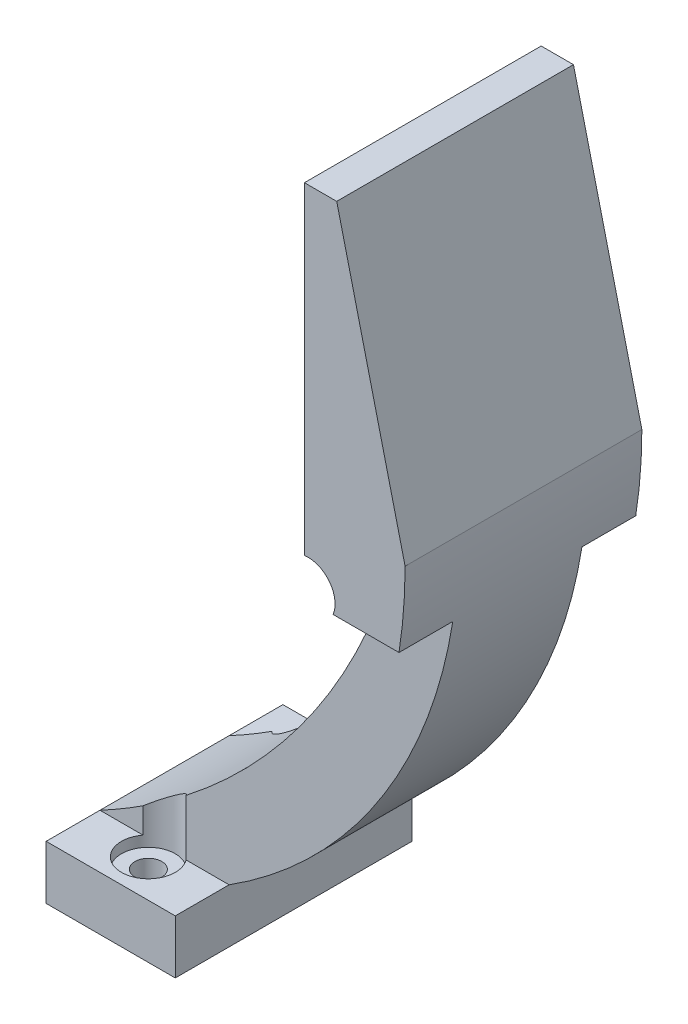
ISO-10303-21;
HEADER;
FILE_DESCRIPTION(('STEP AP214'),'2;1');
FILE_NAME('part.step','',(''),(''),'','','');
FILE_SCHEMA(('AUTOMOTIVE_DESIGN { 1 0 10303 214 1 1 1 1 }'));
ENDSEC;
DATA;
#1=APPLICATION_CONTEXT('core data for automotive mechanical design processes');
#2=APPLICATION_PROTOCOL_DEFINITION('international standard','automotive_design',2000,#1);
#3=PRODUCT_CONTEXT('',#1,'mechanical');
#4=PRODUCT('Part','Part','',(#3));
#5=PRODUCT_RELATED_PRODUCT_CATEGORY('part','',(#4));
#6=PRODUCT_DEFINITION_FORMATION('','',#4);
#7=PRODUCT_DEFINITION_CONTEXT('part definition',#1,'design');
#8=PRODUCT_DEFINITION('design','',#6,#7);
#9=PRODUCT_DEFINITION_SHAPE('','',#8);
#10=(LENGTH_UNIT() NAMED_UNIT(*) SI_UNIT(.MILLI.,.METRE.));
#11=(NAMED_UNIT(*) PLANE_ANGLE_UNIT() SI_UNIT($,.RADIAN.));
#12=(NAMED_UNIT(*) SI_UNIT($,.STERADIAN.) SOLID_ANGLE_UNIT());
#13=UNCERTAINTY_MEASURE_WITH_UNIT(LENGTH_MEASURE(1.E-05),#10,'distance_accuracy_value','');
#14=(GEOMETRIC_REPRESENTATION_CONTEXT(3) GLOBAL_UNCERTAINTY_ASSIGNED_CONTEXT((#13)) GLOBAL_UNIT_ASSIGNED_CONTEXT((#10,
#11,#12)) REPRESENTATION_CONTEXT('',''));
#15=CARTESIAN_POINT('',(0.,0.,0.));
#16=DIRECTION('',(0.,0.,1.));
#17=DIRECTION('',(1.,0.,0.));
#18=AXIS2_PLACEMENT_3D('',#15,#16,#17);
#19=CARTESIAN_POINT('',(33.356201637698,5.,5.));
#20=DIRECTION('',(0.,0.,1.));
#21=DIRECTION('',(1.,0.,0.));
#22=AXIS2_PLACEMENT_3D('',#19,#20,#21);
#23=PLANE('',#22);
#24=CARTESIAN_POINT('',(-26.3061199309047,54.2562220083352,5.));
#25=DIRECTION('',(0.,0.,1.));
#26=DIRECTION('',(1.,0.,0.));
#27=AXIS2_PLACEMENT_3D('',#24,#25,#26);
#28=CIRCLE('',#27,55.840732018425);
#29=CARTESIAN_POINT('',(0.,5.,5.));
#30=VERTEX_POINT('',#29);
#31=CARTESIAN_POINT('',(4.,7.35498058460349,5.));
#32=VERTEX_POINT('',#31);
#33=EDGE_CURVE('E291',#30,#32,#28,.T.);
#34=ORIENTED_EDGE('',*,*,#33,.T.);
#35=DIRECTION('',(0.,-1.,0.));
#36=VECTOR('',#35,1.);
#37=CARTESIAN_POINT('',(4.00000000000001,70.001,5.));
#38=LINE('',#37,#36);
#39=CARTESIAN_POINT('',(4.,5.00000000000001,5.));
#40=VERTEX_POINT('',#39);
#41=EDGE_CURVE('E398',#40,#32,#38,.F.);
#42=ORIENTED_EDGE('',*,*,#41,.F.);
#43=DIRECTION('',(-1.,0.,0.));
#44=VECTOR('',#43,1.);
#45=CARTESIAN_POINT('',(33.356201637698,5.,5.));
#46=LINE('',#45,#44);
#47=EDGE_CURVE('E171',#40,#30,#46,.T.);
#48=ORIENTED_EDGE('',*,*,#47,.T.);
#49=EDGE_LOOP('',(#34,#42,#48));
#50=FACE_BOUND('',#49,.T.);
#51=ADVANCED_FACE('F33',(#50),#23,.F.);
#52=CARTESIAN_POINT('',(33.356201637698,5.,17.));
#53=DIRECTION('',(0.,0.,-1.));
#54=DIRECTION('',(-1.,0.,0.));
#55=AXIS2_PLACEMENT_3D('',#52,#53,#54);
#56=PLANE('',#55);
#57=CARTESIAN_POINT('',(-26.3061199309047,54.2562220083352,17.));
#58=DIRECTION('',(0.,0.,-1.));
#59=DIRECTION('',(-1.,0.,0.));
#60=AXIS2_PLACEMENT_3D('',#57,#58,#59);
#61=CIRCLE('',#60,55.840732018425);
#62=CARTESIAN_POINT('',(26.6647533171236,36.5849475864136,17.));
#63=VERTEX_POINT('',#62);
#64=CARTESIAN_POINT('',(8.,10.1962913724396,17.));
#65=VERTEX_POINT('',#64);
#66=EDGE_CURVE('E194',#63,#65,#61,.T.);
#67=ORIENTED_EDGE('',*,*,#66,.T.);
#68=DIRECTION('',(0.,-1.,0.));
#69=VECTOR('',#68,1.);
#70=CARTESIAN_POINT('',(8.00000000000001,70.001,17.));
#71=LINE('',#70,#69);
#72=CARTESIAN_POINT('',(8.,5.00000000000001,17.));
#73=VERTEX_POINT('',#72);
#74=EDGE_CURVE('E380',#73,#65,#71,.F.);
#75=ORIENTED_EDGE('',*,*,#74,.F.);
#76=DIRECTION('',(-1.,0.,0.));
#77=VECTOR('',#76,1.);
#78=CARTESIAN_POINT('',(33.356201637698,5.,17.));
#79=LINE('',#78,#77);
#80=CARTESIAN_POINT('',(12.,5.,17.));
#81=VERTEX_POINT('',#80);
#82=EDGE_CURVE('E206',#81,#73,#79,.T.);
#83=ORIENTED_EDGE('',*,*,#82,.F.);
#84=CARTESIAN_POINT('',(-12.5436072476083,43.7854611983024,17.));
#85=DIRECTION('',(0.,0.,-1.));
#86=DIRECTION('',(-1.,0.,0.));
#87=AXIS2_PLACEMENT_3D('',#84,#85,#86);
#88=CIRCLE('',#87,45.8988088853063);
#89=CARTESIAN_POINT('',(32.786882059423,36.5849475864136,17.));
#90=VERTEX_POINT('',#89);
#91=EDGE_CURVE('E197',#81,#90,#88,.F.);
#92=ORIENTED_EDGE('',*,*,#91,.T.);
#93=DIRECTION('',(-1.,0.,0.));
#94=VECTOR('',#93,1.);
#95=CARTESIAN_POINT('',(33.356201637698,36.5849475864136,17.));
#96=LINE('',#95,#94);
#97=EDGE_CURVE('E210',#90,#63,#96,.T.);
#98=ORIENTED_EDGE('',*,*,#97,.T.);
#99=EDGE_LOOP('',(#67,#75,#83,#92,#98));
#100=FACE_BOUND('',#99,.T.);
#101=ADVANCED_FACE('F329',(#100),#56,.F.);
#102=CARTESIAN_POINT('',(-12.5436072476083,43.7854611983024,22.));
#103=DIRECTION('',(0.,0.,1.));
#104=DIRECTION('',(1.,0.,0.));
#105=AXIS2_PLACEMENT_3D('',#102,#103,#104);
#106=PLANE('',#105);
#107=DIRECTION('',(-1.,0.,0.));
#108=VECTOR('',#107,1.);
#109=CARTESIAN_POINT('',(33.356201637698,5.,22.));
#110=LINE('',#109,#108);
#111=CARTESIAN_POINT('',(12.,5.,22.));
#112=VERTEX_POINT('',#111);
#113=CARTESIAN_POINT('',(0.,5.,22.));
#114=VERTEX_POINT('',#113);
#115=EDGE_CURVE('E202',#112,#114,#110,.T.);
#116=ORIENTED_EDGE('',*,*,#115,.T.);
#117=DIRECTION('',(0.,-1.,0.));
#118=VECTOR('',#117,1.);
#119=CARTESIAN_POINT('',(0.,0.,22.));
#120=LINE('',#119,#118);
#121=CARTESIAN_POINT('',(0.,0.,22.));
#122=VERTEX_POINT('',#121);
#123=EDGE_CURVE('E233',#114,#122,#120,.T.);
#124=ORIENTED_EDGE('',*,*,#123,.T.);
#125=DIRECTION('',(1.,0.,0.));
#126=VECTOR('',#125,1.);
#127=CARTESIAN_POINT('',(0.,0.,22.));
#128=LINE('',#127,#126);
#129=CARTESIAN_POINT('',(12.,0.,22.));
#130=VERTEX_POINT('',#129);
#131=EDGE_CURVE('E215',#122,#130,#128,.T.);
#132=ORIENTED_EDGE('',*,*,#131,.T.);
#133=DIRECTION('',(0.,1.,0.));
#134=VECTOR('',#133,1.);
#135=CARTESIAN_POINT('',(12.,0.,22.));
#136=LINE('',#135,#134);
#137=EDGE_CURVE('E218',#130,#112,#136,.T.);
#138=ORIENTED_EDGE('',*,*,#137,.T.);
#139=EDGE_LOOP('',(#116,#124,#132,#138));
#140=FACE_BOUND('',#139,.T.);
#141=ADVANCED_FACE('F314',(#140),#106,.T.);
#142=CARTESIAN_POINT('',(-12.5436072476083,43.7854611983024,0.));
#143=DIRECTION('',(0.,0.,1.));
#144=DIRECTION('',(1.,0.,0.));
#145=AXIS2_PLACEMENT_3D('',#142,#143,#144);
#146=PLANE('',#145);
#147=DIRECTION('',(0.,-1.,0.));
#148=VECTOR('',#147,1.);
#149=CARTESIAN_POINT('',(0.,0.,0.));
#150=LINE('',#149,#148);
#151=CARTESIAN_POINT('',(0.,5.,0.));
#152=VERTEX_POINT('',#151);
#153=CARTESIAN_POINT('',(0.,0.,0.));
#154=VERTEX_POINT('',#153);
#155=EDGE_CURVE('E219',#152,#154,#150,.T.);
#156=ORIENTED_EDGE('',*,*,#155,.F.);
#157=DIRECTION('',(-1.,0.,0.));
#158=VECTOR('',#157,1.);
#159=CARTESIAN_POINT('',(33.356201637698,5.,0.));
#160=LINE('',#159,#158);
#161=CARTESIAN_POINT('',(12.,5.,0.));
#162=VERTEX_POINT('',#161);
#163=EDGE_CURVE('E182',#162,#152,#160,.T.);
#164=ORIENTED_EDGE('',*,*,#163,.F.);
#165=DIRECTION('',(0.,1.,0.));
#166=VECTOR('',#165,1.);
#167=CARTESIAN_POINT('',(12.,0.,0.));
#168=LINE('',#167,#166);
#169=CARTESIAN_POINT('',(12.,0.,0.));
#170=VERTEX_POINT('',#169);
#171=EDGE_CURVE('E238',#170,#162,#168,.T.);
#172=ORIENTED_EDGE('',*,*,#171,.F.);
#173=DIRECTION('',(1.,0.,0.));
#174=VECTOR('',#173,1.);
#175=CARTESIAN_POINT('',(0.,0.,0.));
#176=LINE('',#175,#174);
#177=EDGE_CURVE('E180',#154,#170,#176,.T.);
#178=ORIENTED_EDGE('',*,*,#177,.F.);
#179=EDGE_LOOP('',(#156,#164,#172,#178));
#180=FACE_BOUND('',#179,.T.);
#181=ADVANCED_FACE('F320',(#180),#146,.F.);
#182=CARTESIAN_POINT('',(0.,0.,22.));
#183=DIRECTION('',(0.,1.,0.));
#184=DIRECTION('',(-1.,0.,0.));
#185=AXIS2_PLACEMENT_3D('',#182,#183,#184);
#186=PLANE('',#185);
#187=CARTESIAN_POINT('',(6.,0.,18.5));
#188=DIRECTION('',(0.,-1.,0.));
#189=DIRECTION('',(1.,0.,0.));
#190=AXIS2_PLACEMENT_3D('',#187,#188,#189);
#191=CIRCLE('',#190,1.25);
#192=CARTESIAN_POINT('',(7.25,0.,18.5));
#193=VERTEX_POINT('',#192);
#194=EDGE_CURVE('E421',#193,#193,#191,.T.);
#195=ORIENTED_EDGE('',*,*,#194,.F.);
#196=EDGE_LOOP('',(#195));
#197=FACE_BOUND('',#196,.T.);
#198=CARTESIAN_POINT('',(6.,0.,3.5));
#199=DIRECTION('',(0.,-1.,0.));
#200=DIRECTION('',(1.,0.,0.));
#201=AXIS2_PLACEMENT_3D('',#198,#199,#200);
#202=CIRCLE('',#201,1.25);
#203=CARTESIAN_POINT('',(7.25,0.,3.5));
#204=VERTEX_POINT('',#203);
#205=EDGE_CURVE('E418',#204,#204,#202,.T.);
#206=ORIENTED_EDGE('',*,*,#205,.F.);
#207=EDGE_LOOP('',(#206));
#208=FACE_BOUND('',#207,.T.);
#209=ORIENTED_EDGE('',*,*,#177,.T.);
#210=DIRECTION('',(0.,0.,-1.));
#211=VECTOR('',#210,1.);
#212=CARTESIAN_POINT('',(12.,0.,22.));
#213=LINE('',#212,#211);
#214=EDGE_CURVE('E11',#130,#170,#213,.T.);
#215=ORIENTED_EDGE('',*,*,#214,.F.);
#216=ORIENTED_EDGE('',*,*,#131,.F.);
#217=DIRECTION('',(0.,0.,-1.));
#218=VECTOR('',#217,1.);
#219=CARTESIAN_POINT('',(0.,0.,22.));
#220=LINE('',#219,#218);
#221=EDGE_CURVE('E235',#122,#154,#220,.T.);
#222=ORIENTED_EDGE('',*,*,#221,.T.);
#223=EDGE_LOOP('',(#209,#215,#216,#222));
#224=FACE_BOUND('',#223,.T.);
#225=ADVANCED_FACE('F35',(#197,#208,#224),#186,.F.);
#226=CARTESIAN_POINT('',(12.,0.,22.));
#227=DIRECTION('',(-1.,0.,0.));
#228=DIRECTION('',(0.,-1.,0.));
#229=AXIS2_PLACEMENT_3D('',#226,#227,#228);
#230=PLANE('',#229);
#231=ORIENTED_EDGE('',*,*,#171,.T.);
#232=DIRECTION('',(0.,0.,-1.));
#233=VECTOR('',#232,1.);
#234=CARTESIAN_POINT('',(12.,4.99999999999999,22.));
#235=LINE('',#234,#233);
#236=CARTESIAN_POINT('',(12.,5.,5.));
#237=VERTEX_POINT('',#236);
#238=EDGE_CURVE('E287',#237,#162,#235,.T.);
#239=ORIENTED_EDGE('',*,*,#238,.F.);
#240=DIRECTION('',(0.,0.,-1.));
#241=VECTOR('',#240,1.);
#242=CARTESIAN_POINT('',(12.,4.99999999999999,22.));
#243=LINE('',#242,#241);
#244=EDGE_CURVE('E274',#81,#237,#243,.T.);
#245=ORIENTED_EDGE('',*,*,#244,.F.);
#246=EDGE_CURVE('E41',#112,#81,#243,.T.);
#247=ORIENTED_EDGE('',*,*,#246,.F.);
#248=ORIENTED_EDGE('',*,*,#137,.F.);
#249=ORIENTED_EDGE('',*,*,#214,.T.);
#250=EDGE_LOOP('',(#231,#239,#245,#247,#248,#249));
#251=FACE_BOUND('',#250,.T.);
#252=ADVANCED_FACE('F286',(#251),#230,.F.);
#253=CARTESIAN_POINT('',(-12.5436072476083,43.7854611983024,22.));
#254=DIRECTION('',(0.,0.,-1.));
#255=DIRECTION('',(-1.,0.,0.));
#256=AXIS2_PLACEMENT_3D('',#253,#254,#255);
#257=CYLINDRICAL_SURFACE('',#256,45.8988088853063);
#258=CARTESIAN_POINT('',(-12.5436072476083,43.7854611983024,5.));
#259=DIRECTION('',(0.,0.,1.));
#260=DIRECTION('',(1.,0.,0.));
#261=AXIS2_PLACEMENT_3D('',#258,#259,#260);
#262=CIRCLE('',#261,45.8988088853063);
#263=CARTESIAN_POINT('',(32.786882059423,36.5849475864136,5.));
#264=VERTEX_POINT('',#263);
#265=EDGE_CURVE('E175',#264,#237,#262,.F.);
#266=ORIENTED_EDGE('',*,*,#265,.F.);
#267=DIRECTION('',(0.,0.,-1.));
#268=VECTOR('',#267,1.);
#269=CARTESIAN_POINT('',(32.786882059423,36.5849475864136,22.));
#270=LINE('',#269,#268);
#271=CARTESIAN_POINT('',(32.786882059423,36.5849475864136,0.));
#272=VERTEX_POINT('',#271);
#273=EDGE_CURVE('E177',#272,#264,#270,.F.);
#274=ORIENTED_EDGE('',*,*,#273,.F.);
#275=CARTESIAN_POINT('',(-12.5436072476083,43.7854611983024,0.));
#276=DIRECTION('',(0.,0.,1.));
#277=DIRECTION('',(1.,0.,0.));
#278=AXIS2_PLACEMENT_3D('',#275,#276,#277);
#279=CIRCLE('',#278,45.8988088853063);
#280=CARTESIAN_POINT('',(33.3551912579871,43.816329185376,0.));
#281=VERTEX_POINT('',#280);
#282=EDGE_CURVE('E241',#272,#281,#279,.T.);
#283=ORIENTED_EDGE('',*,*,#282,.T.);
#284=DIRECTION('',(0.,0.,-1.));
#285=VECTOR('',#284,1.);
#286=CARTESIAN_POINT('',(33.3551912579871,43.816329185376,22.));
#287=LINE('',#286,#285);
#288=CARTESIAN_POINT('',(33.3551912579871,43.816329185376,22.));
#289=VERTEX_POINT('',#288);
#290=EDGE_CURVE('E272',#289,#281,#287,.T.);
#291=ORIENTED_EDGE('',*,*,#290,.F.);
#292=CARTESIAN_POINT('',(-12.5436072476083,43.7854611983024,22.));
#293=DIRECTION('',(0.,0.,1.));
#294=DIRECTION('',(1.,0.,0.));
#295=AXIS2_PLACEMENT_3D('',#292,#293,#294);
#296=CIRCLE('',#295,45.8988088853063);
#297=CARTESIAN_POINT('',(32.786882059423,36.5849475864136,22.));
#298=VERTEX_POINT('',#297);
#299=EDGE_CURVE('E222',#298,#289,#296,.T.);
#300=ORIENTED_EDGE('',*,*,#299,.F.);
#301=DIRECTION('',(0.,0.,-1.));
#302=VECTOR('',#301,1.);
#303=CARTESIAN_POINT('',(32.786882059423,36.5849475864136,22.));
#304=LINE('',#303,#302);
#305=EDGE_CURVE('E205',#90,#298,#304,.F.);
#306=ORIENTED_EDGE('',*,*,#305,.F.);
#307=ORIENTED_EDGE('',*,*,#91,.F.);
#308=ORIENTED_EDGE('',*,*,#244,.T.);
#309=EDGE_LOOP('',(#266,#274,#283,#291,#300,#306,#307,#308));
#310=FACE_BOUND('',#309,.T.);
#311=ADVANCED_FACE('F282',(#310),#257,.T.);
#312=CARTESIAN_POINT('',(27.,70.,22.));
#313=DIRECTION('',(-0.971785189538385,-0.235867643804411,0.));
#314=DIRECTION('',(0.235867643804411,-0.971785189538385,0.));
#315=AXIS2_PLACEMENT_3D('',#312,#313,#314);
#316=PLANE('',#315);
#317=DIRECTION('',(-0.235867643804411,0.971785189538385,0.));
#318=VECTOR('',#317,1.);
#319=CARTESIAN_POINT('',(27.,70.,0.));
#320=LINE('',#319,#318);
#321=CARTESIAN_POINT('',(27.,70.,0.));
#322=VERTEX_POINT('',#321);
#323=EDGE_CURVE('E243',#281,#322,#320,.T.);
#324=ORIENTED_EDGE('',*,*,#323,.T.);
#325=DIRECTION('',(0.,0.,-1.));
#326=VECTOR('',#325,1.);
#327=CARTESIAN_POINT('',(27.,70.,22.));
#328=LINE('',#327,#326);
#329=CARTESIAN_POINT('',(27.,70.,22.));
#330=VERTEX_POINT('',#329);
#331=EDGE_CURVE('E269',#330,#322,#328,.T.);
#332=ORIENTED_EDGE('',*,*,#331,.F.);
#333=DIRECTION('',(-0.235867643804411,0.971785189538385,0.));
#334=VECTOR('',#333,1.);
#335=CARTESIAN_POINT('',(27.,70.,22.));
#336=LINE('',#335,#334);
#337=EDGE_CURVE('E224',#289,#330,#336,.T.);
#338=ORIENTED_EDGE('',*,*,#337,.F.);
#339=ORIENTED_EDGE('',*,*,#290,.T.);
#340=EDGE_LOOP('',(#324,#332,#338,#339));
#341=FACE_BOUND('',#340,.T.);
#342=ADVANCED_FACE('F444',(#341),#316,.F.);
#343=CARTESIAN_POINT('',(24.,70.,22.));
#344=DIRECTION('',(0.,-1.,0.));
#345=DIRECTION('',(0.,0.,-1.));
#346=AXIS2_PLACEMENT_3D('',#343,#344,#345);
#347=PLANE('',#346);
#348=DIRECTION('',(-1.,0.,0.));
#349=VECTOR('',#348,1.);
#350=CARTESIAN_POINT('',(24.,70.,0.));
#351=LINE('',#350,#349);
#352=CARTESIAN_POINT('',(24.,70.,0.));
#353=VERTEX_POINT('',#352);
#354=EDGE_CURVE('E245',#322,#353,#351,.T.);
#355=ORIENTED_EDGE('',*,*,#354,.T.);
#356=DIRECTION('',(0.,0.,-1.));
#357=VECTOR('',#356,1.);
#358=CARTESIAN_POINT('',(24.,70.,22.));
#359=LINE('',#358,#357);
#360=CARTESIAN_POINT('',(24.,70.,22.));
#361=VERTEX_POINT('',#360);
#362=EDGE_CURVE('E266',#361,#353,#359,.T.);
#363=ORIENTED_EDGE('',*,*,#362,.F.);
#364=DIRECTION('',(-1.,0.,0.));
#365=VECTOR('',#364,1.);
#366=CARTESIAN_POINT('',(24.,70.,22.));
#367=LINE('',#366,#365);
#368=EDGE_CURVE('E226',#330,#361,#367,.T.);
#369=ORIENTED_EDGE('',*,*,#368,.F.);
#370=ORIENTED_EDGE('',*,*,#331,.T.);
#371=EDGE_LOOP('',(#355,#363,#369,#370));
#372=FACE_BOUND('',#371,.T.);
#373=ADVANCED_FACE('F456',(#372),#347,.F.);
#374=CARTESIAN_POINT('',(24.,40.,22.));
#375=DIRECTION('',(1.,0.,0.));
#376=DIRECTION('',(0.,0.,-1.));
#377=AXIS2_PLACEMENT_3D('',#374,#375,#376);
#378=PLANE('',#377);
#379=DIRECTION('',(0.,-1.,0.));
#380=VECTOR('',#379,1.);
#381=CARTESIAN_POINT('',(24.,40.,0.));
#382=LINE('',#381,#380);
#383=CARTESIAN_POINT('',(24.,40.,0.));
#384=VERTEX_POINT('',#383);
#385=EDGE_CURVE('E247',#353,#384,#382,.T.);
#386=ORIENTED_EDGE('',*,*,#385,.T.);
#387=DIRECTION('',(0.,0.,-1.));
#388=VECTOR('',#387,1.);
#389=CARTESIAN_POINT('',(24.,40.,22.));
#390=LINE('',#389,#388);
#391=CARTESIAN_POINT('',(24.,40.,22.));
#392=VERTEX_POINT('',#391);
#393=EDGE_CURVE('E263',#392,#384,#390,.T.);
#394=ORIENTED_EDGE('',*,*,#393,.F.);
#395=DIRECTION('',(0.,-1.,0.));
#396=VECTOR('',#395,1.);
#397=CARTESIAN_POINT('',(24.,40.,22.));
#398=LINE('',#397,#396);
#399=EDGE_CURVE('E228',#361,#392,#398,.T.);
#400=ORIENTED_EDGE('',*,*,#399,.F.);
#401=ORIENTED_EDGE('',*,*,#362,.T.);
#402=EDGE_LOOP('',(#386,#394,#400,#401));
#403=FACE_BOUND('',#402,.T.);
#404=ADVANCED_FACE('F454',(#403),#378,.F.);
#405=CARTESIAN_POINT('',(24.3479548427376,37.5243329328411,22.));
#406=DIRECTION('',(0.,0.,-1.));
#407=DIRECTION('',(-1.,0.,0.));
#408=AXIS2_PLACEMENT_3D('',#405,#406,#407);
#409=CYLINDRICAL_SURFACE('',#408,2.5);
#410=CARTESIAN_POINT('',(24.3479548427376,37.5243329328411,0.));
#411=DIRECTION('',(0.,0.,-1.));
#412=DIRECTION('',(1.,0.,0.));
#413=AXIS2_PLACEMENT_3D('',#410,#411,#412);
#414=CIRCLE('',#413,2.5);
#415=CARTESIAN_POINT('',(26.6647533171236,36.5849475864135,0.));
#416=VERTEX_POINT('',#415);
#417=EDGE_CURVE('E249',#384,#416,#414,.T.);
#418=ORIENTED_EDGE('',*,*,#417,.T.);
#419=DIRECTION('',(0.,0.,-1.));
#420=VECTOR('',#419,1.);
#421=CARTESIAN_POINT('',(26.6647533171236,36.5849475864135,22.));
#422=LINE('',#421,#420);
#423=CARTESIAN_POINT('',(26.6647533171236,36.5849475864136,5.));
#424=VERTEX_POINT('',#423);
#425=EDGE_CURVE('E214',#424,#416,#422,.T.);
#426=ORIENTED_EDGE('',*,*,#425,.F.);
#427=DIRECTION('',(0.,0.,-1.));
#428=VECTOR('',#427,1.);
#429=CARTESIAN_POINT('',(26.6647533171236,36.5849475864135,22.));
#430=LINE('',#429,#428);
#431=EDGE_CURVE('E259',#63,#424,#430,.T.);
#432=ORIENTED_EDGE('',*,*,#431,.F.);
#433=CARTESIAN_POINT('',(26.6647533171236,36.5849475864136,22.));
#434=VERTEX_POINT('',#433);
#435=EDGE_CURVE('E260',#434,#63,#430,.T.);
#436=ORIENTED_EDGE('',*,*,#435,.F.);
#437=CARTESIAN_POINT('',(24.3479548427376,37.5243329328411,22.));
#438=DIRECTION('',(0.,0.,-1.));
#439=DIRECTION('',(1.,0.,0.));
#440=AXIS2_PLACEMENT_3D('',#437,#438,#439);
#441=CIRCLE('',#440,2.5);
#442=EDGE_CURVE('E230',#392,#434,#441,.T.);
#443=ORIENTED_EDGE('',*,*,#442,.F.);
#444=ORIENTED_EDGE('',*,*,#393,.T.);
#445=EDGE_LOOP('',(#418,#426,#432,#436,#443,#444));
#446=FACE_BOUND('',#445,.T.);
#447=ADVANCED_FACE('F433',(#446),#409,.F.);
#448=CARTESIAN_POINT('',(-26.3061199309047,54.2562220083352,22.));
#449=DIRECTION('',(0.,0.,-1.));
#450=DIRECTION('',(-1.,0.,0.));
#451=AXIS2_PLACEMENT_3D('',#448,#449,#450);
#452=CYLINDRICAL_SURFACE('',#451,55.840732018425);
#453=CARTESIAN_POINT('',(8.00000000000001,10.1962913724396,5.));
#454=VERTEX_POINT('',#453);
#455=EDGE_CURVE('E289',#454,#424,#28,.T.);
#456=ORIENTED_EDGE('',*,*,#455,.F.);
#457=CARTESIAN_POINT('',(4.,7.35498058460349,5.));
#458=CARTESIAN_POINT('',(4.09136954685735,7.41400017057102,5.12188057300369));
#459=CARTESIAN_POINT('',(4.19205800849099,7.47945808553372,5.2329184361809));
#460=CARTESIAN_POINT('',(4.40684763211889,7.62021869367744,5.43212710944672));
#461=CARTESIAN_POINT('',(4.52086576873092,7.69546074377204,5.52042953887321));
#462=CARTESIAN_POINT('',(4.75783091923825,7.85321946387558,5.6741512754406));
#463=CARTESIAN_POINT('',(4.88074241209624,7.93570744798573,5.73965613836231));
#464=CARTESIAN_POINT('',(5.13254026279049,8.10623675153995,5.84869370794221));
#465=CARTESIAN_POINT('',(5.26143572256675,8.19428660947863,5.89219166015091));
#466=CARTESIAN_POINT('',(5.54166499170129,8.38750670029319,5.96248011792456));
#467=CARTESIAN_POINT('',(5.69346700363183,8.49326535502284,5.98579057069326));
#468=CARTESIAN_POINT('',(5.99721978380006,8.70716940821204,6.00463279697472));
#469=CARTESIAN_POINT('',(6.14917055703294,8.81531696796099,6.00013829548921));
#470=CARTESIAN_POINT('',(6.46749998552568,9.04427761878349,5.96171928658706));
#471=CARTESIAN_POINT('',(6.63348288197127,9.16508989085117,5.92440794094409));
#472=CARTESIAN_POINT('',(6.95653919789532,9.40287167542023,5.81603821824644));
#473=CARTESIAN_POINT('',(7.11362823263164,9.51984776099938,5.74504117965299));
#474=CARTESIAN_POINT('',(7.40133877202966,9.7362924368952,5.57643648475957));
#475=CARTESIAN_POINT('',(7.53307502277615,9.83640376982875,5.48160760561993));
#476=CARTESIAN_POINT('',(7.7183902443204,9.97839211470815,5.31768944645855));
#477=CARTESIAN_POINT('',(7.77827187735874,10.0244820373975,5.25923307554572));
#478=CARTESIAN_POINT('',(7.89307972017901,10.1131887297191,5.13505292124778));
#479=CARTESIAN_POINT('',(7.94799831677063,10.1558001540449,5.06931830568789));
#480=CARTESIAN_POINT('',(8.00000000000001,10.1962913724396,5.));
#481=B_SPLINE_CURVE_WITH_KNOTS('',3,(#457,#458,#459,#460,#461,#462,#463,#464,#465,#466,#467,
#468,#469,#470,#471,#472,#473,#474,#475,#476,#477,#478,#479,#480),.UNSPECIFIED.,.F.,.F.,(4,2,2,
2,2,2,2,2,2,2,2,4),(0.,0.4885516633909,0.974207975782027,1.45802152712582,1.94259677527223,
2.49978064589521,3.05749112195424,3.68055302702432,4.30248472410069,4.87148919265999,
5.15768263592709,5.444307895023),.UNSPECIFIED.);
#482=EDGE_CURVE('E48',#32,#454,#481,.T.);
#483=ORIENTED_EDGE('',*,*,#482,.F.);
#484=ORIENTED_EDGE('',*,*,#33,.F.);
#485=DIRECTION('',(0.,0.,-1.));
#486=VECTOR('',#485,1.);
#487=CARTESIAN_POINT('',(0.,5.,22.));
#488=LINE('',#487,#486);
#489=CARTESIAN_POINT('',(0.,5.,17.));
#490=VERTEX_POINT('',#489);
#491=EDGE_CURVE('E255',#490,#30,#488,.T.);
#492=ORIENTED_EDGE('',*,*,#491,.F.);
#493=CARTESIAN_POINT('',(4.,7.35498058460349,17.));
#494=VERTEX_POINT('',#493);
#495=EDGE_CURVE('E198',#494,#490,#61,.T.);
#496=ORIENTED_EDGE('',*,*,#495,.F.);
#497=CARTESIAN_POINT('',(8.,10.1962913724396,17.));
#498=CARTESIAN_POINT('',(7.95234724347607,10.1591868266086,16.9364754904024));
#499=CARTESIAN_POINT('',(7.90223838925961,10.1202961658523,16.8759564178986));
#500=CARTESIAN_POINT('',(7.79777345301181,10.0395266301074,16.7610222687113));
#501=CARTESIAN_POINT('',(7.74342238793617,9.9976512898254,16.706600161745));
#502=CARTESIAN_POINT('',(7.57549789005569,9.86880182490985,16.5530226908093));
#503=CARTESIAN_POINT('',(7.45646850714886,9.77814746622344,16.4627963548945));
#504=CARTESIAN_POINT('',(7.20872458683368,9.59117329177361,16.306749066603));
#505=CARTESIAN_POINT('',(7.08005627988921,9.49488094908677,16.240819597581));
#506=CARTESIAN_POINT('',(6.81543979880087,9.29872184889116,16.1324002413257));
#507=CARTESIAN_POINT('',(6.67947932617287,9.19884915344503,16.0899514115769));
#508=CARTESIAN_POINT('',(6.38049693635651,8.98137357945981,16.0236399447427));
#509=CARTESIAN_POINT('',(6.21669456332253,8.8635498367161,16.0039686820774));
#510=CARTESIAN_POINT('',(5.88722011462234,8.62928776971883,15.9971112588793));
#511=CARTESIAN_POINT('',(5.72154658970777,8.51285068667399,16.009952283044));
#512=CARTESIAN_POINT('',(5.38578359215253,8.2795525893751,16.0703736316157));
#513=CARTESIAN_POINT('',(5.21581440861135,8.16289238118436,16.1194370673726));
#514=CARTESIAN_POINT('',(4.8855130689814,7.93874121917083,16.2550853037087));
#515=CARTESIAN_POINT('',(4.72515209623572,7.83122239546002,16.3415507777688));
#516=CARTESIAN_POINT('',(4.46736921079337,7.6601279827832,16.5206770604401));
#517=CARTESIAN_POINT('',(4.36552175306012,7.59306076116717,16.6036561384466));
#518=CARTESIAN_POINT('',(4.17320230152206,7.46720819130066,16.788079810795));
#519=CARTESIAN_POINT('',(4.08278242548378,7.40846064964298,16.8896041827107));
#520=CARTESIAN_POINT('',(4.,7.35498058460348,17.));
#521=B_SPLINE_CURVE_WITH_KNOTS('',3,(#497,#498,#499,#500,#501,#502,#503,#504,#505,#506,#507,
#508,#509,#510,#511,#512,#513,#514,#515,#516,#517,#518,#519,#520),.UNSPECIFIED.,.F.,.F.,(4,2,2,
2,2,2,2,2,2,2,2,4),(0.,0.262707857594906,0.525109604772311,1.0467712670061,1.56607396430618,
2.0862818500095,2.69182839173749,3.29788141998378,3.93023016643072,4.56057619326072,
5.00137128869967,5.44410925729228),.UNSPECIFIED.);
#522=EDGE_CURVE('E56',#65,#494,#521,.T.);
#523=ORIENTED_EDGE('',*,*,#522,.F.);
#524=ORIENTED_EDGE('',*,*,#66,.F.);
#525=ORIENTED_EDGE('',*,*,#431,.T.);
#526=EDGE_LOOP('',(#456,#483,#484,#492,#496,#523,#524,#525));
#527=FACE_BOUND('',#526,.T.);
#528=ADVANCED_FACE('F303',(#527),#452,.F.);
#529=CARTESIAN_POINT('',(0.,0.,22.));
#530=DIRECTION('',(1.,0.,0.));
#531=DIRECTION('',(0.,0.,-1.));
#532=AXIS2_PLACEMENT_3D('',#529,#530,#531);
#533=PLANE('',#532);
#534=ORIENTED_EDGE('',*,*,#155,.T.);
#535=ORIENTED_EDGE('',*,*,#221,.F.);
#536=ORIENTED_EDGE('',*,*,#123,.F.);
#537=EDGE_CURVE('E256',#114,#490,#488,.T.);
#538=ORIENTED_EDGE('',*,*,#537,.T.);
#539=ORIENTED_EDGE('',*,*,#491,.T.);
#540=DIRECTION('',(0.,0.,1.));
#541=VECTOR('',#540,1.);
#542=CARTESIAN_POINT('',(0.,5.,5.));
#543=LINE('',#542,#541);
#544=EDGE_CURVE('E185',#152,#30,#543,.T.);
#545=ORIENTED_EDGE('',*,*,#544,.F.);
#546=EDGE_LOOP('',(#534,#535,#536,#538,#539,#545));
#547=FACE_BOUND('',#546,.T.);
#548=ADVANCED_FACE('F306',(#547),#533,.F.);
#549=DIRECTION('',(-1.,0.,0.));
#550=VECTOR('',#549,1.);
#551=CARTESIAN_POINT('',(33.356201637698,36.5849475864136,22.));
#552=LINE('',#551,#550);
#553=EDGE_CURVE('E201',#298,#434,#552,.T.);
#554=ORIENTED_EDGE('',*,*,#553,.F.);
#555=ORIENTED_EDGE('',*,*,#299,.T.);
#556=ORIENTED_EDGE('',*,*,#337,.T.);
#557=ORIENTED_EDGE('',*,*,#368,.T.);
#558=ORIENTED_EDGE('',*,*,#399,.T.);
#559=ORIENTED_EDGE('',*,*,#442,.T.);
#560=EDGE_LOOP('',(#554,#555,#556,#557,#558,#559));
#561=FACE_BOUND('',#560,.T.);
#562=ADVANCED_FACE('F331',(#561),#106,.T.);
#563=ORIENTED_EDGE('',*,*,#282,.F.);
#564=DIRECTION('',(-1.,0.,0.));
#565=VECTOR('',#564,1.);
#566=CARTESIAN_POINT('',(33.356201637698,36.5849475864136,0.));
#567=LINE('',#566,#565);
#568=EDGE_CURVE('E188',#272,#416,#567,.T.);
#569=ORIENTED_EDGE('',*,*,#568,.T.);
#570=ORIENTED_EDGE('',*,*,#417,.F.);
#571=ORIENTED_EDGE('',*,*,#385,.F.);
#572=ORIENTED_EDGE('',*,*,#354,.F.);
#573=ORIENTED_EDGE('',*,*,#323,.F.);
#574=EDGE_LOOP('',(#563,#569,#570,#571,#572,#573));
#575=FACE_BOUND('',#574,.T.);
#576=ADVANCED_FACE('F323',(#575),#146,.F.);
#577=CARTESIAN_POINT('',(33.356201637698,5.,5.));
#578=DIRECTION('',(0.,-1.,0.));
#579=DIRECTION('',(0.,0.,-1.));
#580=AXIS2_PLACEMENT_3D('',#577,#578,#579);
#581=PLANE('',#580);
#582=ORIENTED_EDGE('',*,*,#47,.F.);
#583=CARTESIAN_POINT('',(6.,5.,3.5));
#584=DIRECTION('',(0.,-1.,0.));
#585=DIRECTION('',(0.,0.,-1.));
#586=AXIS2_PLACEMENT_3D('',#583,#584,#585);
#587=CIRCLE('',#586,2.5);
#588=CARTESIAN_POINT('',(8.00000000000001,5.,5.));
#589=VERTEX_POINT('',#588);
#590=EDGE_CURVE('E158',#589,#40,#587,.F.);
#591=ORIENTED_EDGE('',*,*,#590,.F.);
#592=EDGE_CURVE('E168',#237,#589,#46,.T.);
#593=ORIENTED_EDGE('',*,*,#592,.F.);
#594=ORIENTED_EDGE('',*,*,#238,.T.);
#595=ORIENTED_EDGE('',*,*,#163,.T.);
#596=ORIENTED_EDGE('',*,*,#544,.T.);
#597=EDGE_LOOP('',(#582,#591,#593,#594,#595,#596));
#598=FACE_BOUND('',#597,.T.);
#599=ADVANCED_FACE('F167',(#598),#581,.F.);
#600=CARTESIAN_POINT('',(33.356201637698,36.5849475864136,5.));
#601=DIRECTION('',(0.,1.,0.));
#602=DIRECTION('',(0.,0.,1.));
#603=AXIS2_PLACEMENT_3D('',#600,#601,#602);
#604=PLANE('',#603);
#605=ORIENTED_EDGE('',*,*,#273,.T.);
#606=DIRECTION('',(-1.,0.,0.));
#607=VECTOR('',#606,1.);
#608=CARTESIAN_POINT('',(33.356201637698,36.5849475864136,5.));
#609=LINE('',#608,#607);
#610=EDGE_CURVE('E191',#264,#424,#609,.T.);
#611=ORIENTED_EDGE('',*,*,#610,.T.);
#612=ORIENTED_EDGE('',*,*,#425,.T.);
#613=ORIENTED_EDGE('',*,*,#568,.F.);
#614=EDGE_LOOP('',(#605,#611,#612,#613));
#615=FACE_BOUND('',#614,.T.);
#616=ADVANCED_FACE('F346',(#615),#604,.F.);
#617=ORIENTED_EDGE('',*,*,#592,.T.);
#618=DIRECTION('',(0.,-1.,0.));
#619=VECTOR('',#618,1.);
#620=CARTESIAN_POINT('',(8.00000000000002,70.001,5.));
#621=LINE('',#620,#619);
#622=EDGE_CURVE('E155',#454,#589,#621,.T.);
#623=ORIENTED_EDGE('',*,*,#622,.F.);
#624=ORIENTED_EDGE('',*,*,#455,.T.);
#625=ORIENTED_EDGE('',*,*,#610,.F.);
#626=ORIENTED_EDGE('',*,*,#265,.T.);
#627=EDGE_LOOP('',(#617,#623,#624,#625,#626));
#628=FACE_BOUND('',#627,.T.);
#629=ADVANCED_FACE('F173',(#628),#23,.F.);
#630=CARTESIAN_POINT('',(33.356201637698,5.,17.));
#631=DIRECTION('',(0.,-1.,0.));
#632=DIRECTION('',(0.,0.,-1.));
#633=AXIS2_PLACEMENT_3D('',#630,#631,#632);
#634=PLANE('',#633);
#635=ORIENTED_EDGE('',*,*,#82,.T.);
#636=CARTESIAN_POINT('',(6.,5.,18.5));
#637=DIRECTION('',(0.,-1.,0.));
#638=DIRECTION('',(0.,0.,-1.));
#639=AXIS2_PLACEMENT_3D('',#636,#637,#638);
#640=CIRCLE('',#639,2.5);
#641=CARTESIAN_POINT('',(4.,5.,17.));
#642=VERTEX_POINT('',#641);
#643=EDGE_CURVE('E381',#642,#73,#640,.F.);
#644=ORIENTED_EDGE('',*,*,#643,.F.);
#645=EDGE_CURVE('E209',#642,#490,#79,.T.);
#646=ORIENTED_EDGE('',*,*,#645,.T.);
#647=ORIENTED_EDGE('',*,*,#537,.F.);
#648=ORIENTED_EDGE('',*,*,#115,.F.);
#649=ORIENTED_EDGE('',*,*,#246,.T.);
#650=EDGE_LOOP('',(#635,#644,#646,#647,#648,#649));
#651=FACE_BOUND('',#650,.T.);
#652=ADVANCED_FACE('F309',(#651),#634,.F.);
#653=CARTESIAN_POINT('',(33.356201637698,36.5849475864136,17.));
#654=DIRECTION('',(0.,1.,0.));
#655=DIRECTION('',(0.,0.,1.));
#656=AXIS2_PLACEMENT_3D('',#653,#654,#655);
#657=PLANE('',#656);
#658=ORIENTED_EDGE('',*,*,#305,.T.);
#659=ORIENTED_EDGE('',*,*,#553,.T.);
#660=ORIENTED_EDGE('',*,*,#435,.T.);
#661=ORIENTED_EDGE('',*,*,#97,.F.);
#662=EDGE_LOOP('',(#658,#659,#660,#661));
#663=FACE_BOUND('',#662,.T.);
#664=ADVANCED_FACE('F351',(#663),#657,.F.);
#665=ORIENTED_EDGE('',*,*,#645,.F.);
#666=DIRECTION('',(0.,-1.,0.));
#667=VECTOR('',#666,1.);
#668=CARTESIAN_POINT('',(4.00000000000001,70.001,17.));
#669=LINE('',#668,#667);
#670=EDGE_CURVE('E404',#494,#642,#669,.T.);
#671=ORIENTED_EDGE('',*,*,#670,.F.);
#672=ORIENTED_EDGE('',*,*,#495,.T.);
#673=EDGE_LOOP('',(#665,#671,#672));
#674=FACE_BOUND('',#673,.T.);
#675=ADVANCED_FACE('F342',(#674),#56,.F.);
#676=CARTESIAN_POINT('',(6.,4.,3.5));
#677=DIRECTION('',(0.,-1.,0.));
#678=DIRECTION('',(1.,0.,0.));
#679=AXIS2_PLACEMENT_3D('',#676,#677,#678);
#680=CYLINDRICAL_SURFACE('',#679,1.25);
#681=CARTESIAN_POINT('',(6.,4.,3.5));
#682=DIRECTION('',(0.,-1.,0.));
#683=DIRECTION('',(1.,0.,0.));
#684=AXIS2_PLACEMENT_3D('',#681,#682,#683);
#685=CIRCLE('',#684,1.25);
#686=CARTESIAN_POINT('',(7.25,4.,3.5));
#687=VERTEX_POINT('',#686);
#688=EDGE_CURVE('E417',#687,#687,#685,.T.);
#689=ORIENTED_EDGE('',*,*,#688,.F.);
#690=EDGE_LOOP('',(#689));
#691=FACE_BOUND('',#690,.T.);
#692=ORIENTED_EDGE('',*,*,#205,.T.);
#693=EDGE_LOOP('',(#692));
#694=FACE_BOUND('',#693,.T.);
#695=ADVANCED_FACE('F358',(#691,#694),#680,.F.);
#696=CARTESIAN_POINT('',(6.,4.,18.5));
#697=DIRECTION('',(0.,-1.,0.));
#698=DIRECTION('',(1.,0.,0.));
#699=AXIS2_PLACEMENT_3D('',#696,#697,#698);
#700=CYLINDRICAL_SURFACE('',#699,1.25);
#701=CARTESIAN_POINT('',(6.,4.,18.5));
#702=DIRECTION('',(0.,-1.,0.));
#703=DIRECTION('',(1.,0.,0.));
#704=AXIS2_PLACEMENT_3D('',#701,#702,#703);
#705=CIRCLE('',#704,1.25);
#706=CARTESIAN_POINT('',(7.25,4.,18.5));
#707=VERTEX_POINT('',#706);
#708=EDGE_CURVE('E401',#707,#707,#705,.T.);
#709=ORIENTED_EDGE('',*,*,#708,.F.);
#710=EDGE_LOOP('',(#709));
#711=FACE_BOUND('',#710,.T.);
#712=ORIENTED_EDGE('',*,*,#194,.T.);
#713=EDGE_LOOP('',(#712));
#714=FACE_BOUND('',#713,.T.);
#715=ADVANCED_FACE('F361',(#711,#714),#700,.F.);
#716=CARTESIAN_POINT('',(6.00000000000001,70.001,18.5));
#717=DIRECTION('',(0.,-1.,0.));
#718=DIRECTION('',(1.,0.,0.));
#719=AXIS2_PLACEMENT_3D('',#716,#717,#718);
#720=CYLINDRICAL_SURFACE('',#719,2.5);
#721=CARTESIAN_POINT('',(6.,4.,18.5));
#722=DIRECTION('',(0.,-1.,0.));
#723=DIRECTION('',(1.,0.,0.));
#724=AXIS2_PLACEMENT_3D('',#721,#722,#723);
#725=CIRCLE('',#724,2.5);
#726=CARTESIAN_POINT('',(8.5,4.,18.5));
#727=VERTEX_POINT('',#726);
#728=EDGE_CURVE('E402',#727,#727,#725,.T.);
#729=ORIENTED_EDGE('',*,*,#728,.T.);
#730=EDGE_LOOP('',(#729));
#731=FACE_BOUND('',#730,.T.);
#732=ORIENTED_EDGE('',*,*,#74,.T.);
#733=ORIENTED_EDGE('',*,*,#522,.T.);
#734=ORIENTED_EDGE('',*,*,#670,.T.);
#735=ORIENTED_EDGE('',*,*,#643,.T.);
#736=EDGE_LOOP('',(#732,#733,#734,#735));
#737=FACE_BOUND('',#736,.T.);
#738=ADVANCED_FACE('F365',(#731,#737),#720,.F.);
#739=CARTESIAN_POINT('',(6.,4.,18.5));
#740=DIRECTION('',(0.,-1.,0.));
#741=DIRECTION('',(1.,0.,0.));
#742=AXIS2_PLACEMENT_3D('',#739,#740,#741);
#743=PLANE('',#742);
#744=ORIENTED_EDGE('',*,*,#708,.T.);
#745=EDGE_LOOP('',(#744));
#746=FACE_BOUND('',#745,.T.);
#747=ORIENTED_EDGE('',*,*,#728,.F.);
#748=EDGE_LOOP('',(#747));
#749=FACE_BOUND('',#748,.T.);
#750=ADVANCED_FACE('F370',(#746,#749),#743,.F.);
#751=CARTESIAN_POINT('',(6.00000000000002,70.001,3.5));
#752=DIRECTION('',(0.,-1.,0.));
#753=DIRECTION('',(1.,0.,0.));
#754=AXIS2_PLACEMENT_3D('',#751,#752,#753);
#755=CYLINDRICAL_SURFACE('',#754,2.5);
#756=CARTESIAN_POINT('',(6.,4.,3.5));
#757=DIRECTION('',(0.,-1.,0.));
#758=DIRECTION('',(1.,0.,0.));
#759=AXIS2_PLACEMENT_3D('',#756,#757,#758);
#760=CIRCLE('',#759,2.5);
#761=CARTESIAN_POINT('',(8.5,4.,3.5));
#762=VERTEX_POINT('',#761);
#763=EDGE_CURVE('E163',#762,#762,#760,.T.);
#764=ORIENTED_EDGE('',*,*,#763,.T.);
#765=EDGE_LOOP('',(#764));
#766=FACE_BOUND('',#765,.T.);
#767=ORIENTED_EDGE('',*,*,#41,.T.);
#768=ORIENTED_EDGE('',*,*,#482,.T.);
#769=ORIENTED_EDGE('',*,*,#622,.T.);
#770=ORIENTED_EDGE('',*,*,#590,.T.);
#771=EDGE_LOOP('',(#767,#768,#769,#770));
#772=FACE_BOUND('',#771,.T.);
#773=ADVANCED_FACE('F157',(#766,#772),#755,.F.);
#774=CARTESIAN_POINT('',(6.,4.,3.5));
#775=DIRECTION('',(0.,-1.,0.));
#776=DIRECTION('',(1.,0.,0.));
#777=AXIS2_PLACEMENT_3D('',#774,#775,#776);
#778=PLANE('',#777);
#779=ORIENTED_EDGE('',*,*,#688,.T.);
#780=EDGE_LOOP('',(#779));
#781=FACE_BOUND('',#780,.T.);
#782=ORIENTED_EDGE('',*,*,#763,.F.);
#783=EDGE_LOOP('',(#782));
#784=FACE_BOUND('',#783,.T.);
#785=ADVANCED_FACE('F389',(#781,#784),#778,.F.);
#786=CLOSED_SHELL('',(#51,#101,#141,#181,#225,#252,#311,#342,#373,#404,#447,#528,#548,#562,#576,
#599,#616,#629,#652,#664,#675,#695,#715,#738,#750,#773,#785));
#787=MANIFOLD_SOLID_BREP('B2',#786);
#788=ADVANCED_BREP_SHAPE_REPRESENTATION('',(#18,#787),#14);
#789=SHAPE_DEFINITION_REPRESENTATION(#9,#788);
ENDSEC;
END-ISO-10303-21;
